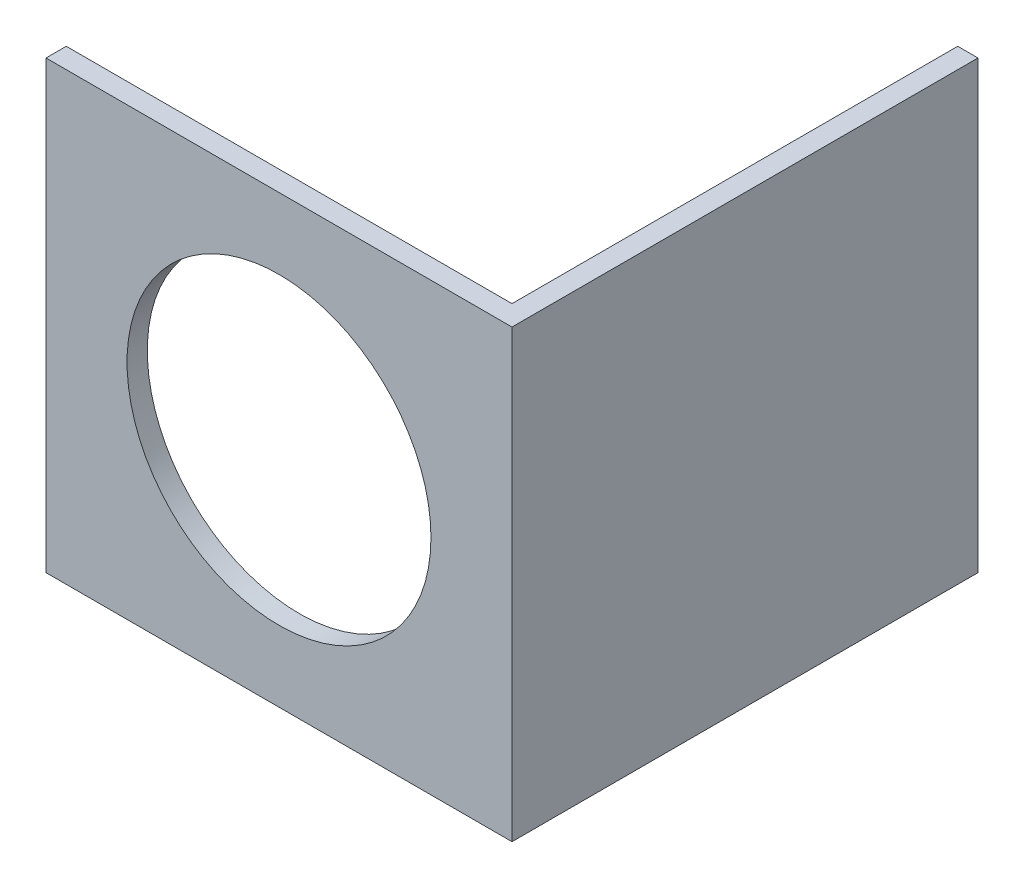
ISO-10303-21;
HEADER;
FILE_DESCRIPTION(('STEP AP214'),'2;1');
FILE_NAME('part.step','',(''),(''),'','','');
FILE_SCHEMA(('AUTOMOTIVE_DESIGN { 1 0 10303 214 1 1 1 1 }'));
ENDSEC;
DATA;
#1=APPLICATION_CONTEXT('core data for automotive mechanical design processes');
#2=APPLICATION_PROTOCOL_DEFINITION('international standard','automotive_design',2000,#1);
#3=PRODUCT_CONTEXT('',#1,'mechanical');
#4=PRODUCT('Part','Part','',(#3));
#5=PRODUCT_RELATED_PRODUCT_CATEGORY('part','',(#4));
#6=PRODUCT_DEFINITION_FORMATION('','',#4);
#7=PRODUCT_DEFINITION_CONTEXT('part definition',#1,'design');
#8=PRODUCT_DEFINITION('design','',#6,#7);
#9=PRODUCT_DEFINITION_SHAPE('','',#8);
#10=(LENGTH_UNIT() NAMED_UNIT(*) SI_UNIT(.MILLI.,.METRE.));
#11=(NAMED_UNIT(*) PLANE_ANGLE_UNIT() SI_UNIT($,.RADIAN.));
#12=(NAMED_UNIT(*) SI_UNIT($,.STERADIAN.) SOLID_ANGLE_UNIT());
#13=UNCERTAINTY_MEASURE_WITH_UNIT(LENGTH_MEASURE(1.E-05),#10,'distance_accuracy_value','');
#14=(GEOMETRIC_REPRESENTATION_CONTEXT(3) GLOBAL_UNCERTAINTY_ASSIGNED_CONTEXT((#13)) GLOBAL_UNIT_ASSIGNED_CONTEXT((#10,
#11,#12)) REPRESENTATION_CONTEXT('',''));
#15=CARTESIAN_POINT('',(0.,0.,0.));
#16=DIRECTION('',(0.,0.,1.));
#17=DIRECTION('',(1.,0.,0.));
#18=AXIS2_PLACEMENT_3D('',#15,#16,#17);
#19=CARTESIAN_POINT('',(-9.57987547909718,44.,17.5119931773014));
#20=DIRECTION('',(1.,0.,0.));
#21=DIRECTION('',(0.,0.,-1.));
#22=AXIS2_PLACEMENT_3D('',#19,#20,#21);
#23=PLANE('',#22);
#24=DIRECTION('',(0.,0.,1.));
#25=VECTOR('',#24,1.);
#26=CARTESIAN_POINT('',(-9.57987547909718,0.,17.5119931773014));
#27=LINE('',#26,#25);
#28=CARTESIAN_POINT('',(-9.57987547909718,0.,17.5119931773014));
#29=VERTEX_POINT('',#28);
#30=CARTESIAN_POINT('',(-9.57987547909718,0.,19.5119931773014));
#31=VERTEX_POINT('',#30);
#32=EDGE_CURVE('E118',#29,#31,#27,.T.);
#33=ORIENTED_EDGE('',*,*,#32,.T.);
#34=DIRECTION('',(0.,-1.,0.));
#35=VECTOR('',#34,1.);
#36=CARTESIAN_POINT('',(-9.57987547909718,44.,19.5119931773014));
#37=LINE('',#36,#35);
#38=CARTESIAN_POINT('',(-9.57987547909718,44.,19.5119931773014));
#39=VERTEX_POINT('',#38);
#40=EDGE_CURVE('E11',#39,#31,#37,.T.);
#41=ORIENTED_EDGE('',*,*,#40,.F.);
#42=DIRECTION('',(0.,0.,1.));
#43=VECTOR('',#42,1.);
#44=CARTESIAN_POINT('',(-9.57987547909718,44.,17.5119931773014));
#45=LINE('',#44,#43);
#46=CARTESIAN_POINT('',(-9.57987547909718,44.,17.5119931773014));
#47=VERTEX_POINT('',#46);
#48=EDGE_CURVE('E128',#47,#39,#45,.T.);
#49=ORIENTED_EDGE('',*,*,#48,.F.);
#50=DIRECTION('',(0.,-1.,0.));
#51=VECTOR('',#50,1.);
#52=CARTESIAN_POINT('',(-9.57987547909718,44.,17.5119931773014));
#53=LINE('',#52,#51);
#54=EDGE_CURVE('E114',#47,#29,#53,.T.);
#55=ORIENTED_EDGE('',*,*,#54,.T.);
#56=EDGE_LOOP('',(#33,#41,#49,#55));
#57=FACE_BOUND('',#56,.T.);
#58=ADVANCED_FACE('F33',(#57),#23,.F.);
#59=CARTESIAN_POINT('',(-9.57987547909718,44.,19.5119931773014));
#60=DIRECTION('',(0.,0.,-1.));
#61=DIRECTION('',(-1.,0.,0.));
#62=AXIS2_PLACEMENT_3D('',#59,#60,#61);
#63=PLANE('',#62);
#64=CARTESIAN_POINT('',(13.4201245209028,22.,19.5119931773014));
#65=DIRECTION('',(0.,0.,1.));
#66=DIRECTION('',(1.,0.,0.));
#67=AXIS2_PLACEMENT_3D('',#64,#65,#66);
#68=CIRCLE('',#67,15.);
#69=CARTESIAN_POINT('',(28.4201245209028,22.,19.5119931773014));
#70=VERTEX_POINT('',#69);
#71=EDGE_CURVE('E214',#70,#70,#68,.T.);
#72=ORIENTED_EDGE('',*,*,#71,.F.);
#73=EDGE_LOOP('',(#72));
#74=FACE_BOUND('',#73,.T.);
#75=DIRECTION('',(1.,0.,0.));
#76=VECTOR('',#75,1.);
#77=CARTESIAN_POINT('',(-9.57987547909718,0.,19.5119931773014));
#78=LINE('',#77,#76);
#79=CARTESIAN_POINT('',(36.4201245209028,0.,19.5119931773014));
#80=VERTEX_POINT('',#79);
#81=EDGE_CURVE('E121',#31,#80,#78,.T.);
#82=ORIENTED_EDGE('',*,*,#81,.T.);
#83=DIRECTION('',(0.,-1.,0.));
#84=VECTOR('',#83,1.);
#85=CARTESIAN_POINT('',(36.4201245209028,44.,19.5119931773014));
#86=LINE('',#85,#84);
#87=CARTESIAN_POINT('',(36.4201245209028,44.,19.5119931773014));
#88=VERTEX_POINT('',#87);
#89=EDGE_CURVE('E42',#88,#80,#86,.T.);
#90=ORIENTED_EDGE('',*,*,#89,.F.);
#91=DIRECTION('',(1.,0.,0.));
#92=VECTOR('',#91,1.);
#93=CARTESIAN_POINT('',(-9.57987547909718,44.,19.5119931773014));
#94=LINE('',#93,#92);
#95=EDGE_CURVE('E87',#39,#88,#94,.T.);
#96=ORIENTED_EDGE('',*,*,#95,.F.);
#97=ORIENTED_EDGE('',*,*,#40,.T.);
#98=EDGE_LOOP('',(#82,#90,#96,#97));
#99=FACE_BOUND('',#98,.T.);
#100=ADVANCED_FACE('F155',(#74,#99),#63,.F.);
#101=CARTESIAN_POINT('',(36.4201245209028,44.,19.5119931773014));
#102=DIRECTION('',(-1.,0.,0.));
#103=DIRECTION('',(0.,0.,1.));
#104=AXIS2_PLACEMENT_3D('',#101,#102,#103);
#105=PLANE('',#104);
#106=DIRECTION('',(0.,0.,-1.));
#107=VECTOR('',#106,1.);
#108=CARTESIAN_POINT('',(36.4201245209028,0.,19.5119931773014));
#109=LINE('',#108,#107);
#110=CARTESIAN_POINT('',(36.4201245209028,0.,-26.4880068226986));
#111=VERTEX_POINT('',#110);
#112=EDGE_CURVE('E123',#80,#111,#109,.T.);
#113=ORIENTED_EDGE('',*,*,#112,.T.);
#114=DIRECTION('',(0.,-1.,0.));
#115=VECTOR('',#114,1.);
#116=CARTESIAN_POINT('',(36.4201245209028,44.,-26.4880068226986));
#117=LINE('',#116,#115);
#118=CARTESIAN_POINT('',(36.4201245209028,44.,-26.4880068226986));
#119=VERTEX_POINT('',#118);
#120=EDGE_CURVE('E109',#119,#111,#117,.T.);
#121=ORIENTED_EDGE('',*,*,#120,.F.);
#122=DIRECTION('',(0.,0.,-1.));
#123=VECTOR('',#122,1.);
#124=CARTESIAN_POINT('',(36.4201245209028,44.,19.5119931773014));
#125=LINE('',#124,#123);
#126=EDGE_CURVE('E100',#88,#119,#125,.T.);
#127=ORIENTED_EDGE('',*,*,#126,.F.);
#128=ORIENTED_EDGE('',*,*,#89,.T.);
#129=EDGE_LOOP('',(#113,#121,#127,#128));
#130=FACE_BOUND('',#129,.T.);
#131=ADVANCED_FACE('F135',(#130),#105,.F.);
#132=CARTESIAN_POINT('',(36.4201245209028,44.,-26.4880068226986));
#133=DIRECTION('',(0.,0.,1.));
#134=DIRECTION('',(1.,0.,0.));
#135=AXIS2_PLACEMENT_3D('',#132,#133,#134);
#136=PLANE('',#135);
#137=DIRECTION('',(-1.,0.,0.));
#138=VECTOR('',#137,1.);
#139=CARTESIAN_POINT('',(36.4201245209028,0.,-26.4880068226986));
#140=LINE('',#139,#138);
#141=CARTESIAN_POINT('',(34.4201245209028,0.,-26.4880068226986));
#142=VERTEX_POINT('',#141);
#143=EDGE_CURVE('E108',#111,#142,#140,.T.);
#144=ORIENTED_EDGE('',*,*,#143,.T.);
#145=DIRECTION('',(0.,-1.,0.));
#146=VECTOR('',#145,1.);
#147=CARTESIAN_POINT('',(34.4201245209028,44.,-26.4880068226986));
#148=LINE('',#147,#146);
#149=CARTESIAN_POINT('',(34.4201245209028,44.,-26.4880068226986));
#150=VERTEX_POINT('',#149);
#151=EDGE_CURVE('E105',#150,#142,#148,.T.);
#152=ORIENTED_EDGE('',*,*,#151,.F.);
#153=DIRECTION('',(-1.,0.,0.));
#154=VECTOR('',#153,1.);
#155=CARTESIAN_POINT('',(36.4201245209028,44.,-26.4880068226986));
#156=LINE('',#155,#154);
#157=EDGE_CURVE('E94',#119,#150,#156,.T.);
#158=ORIENTED_EDGE('',*,*,#157,.F.);
#159=ORIENTED_EDGE('',*,*,#120,.T.);
#160=EDGE_LOOP('',(#144,#152,#158,#159));
#161=FACE_BOUND('',#160,.T.);
#162=ADVANCED_FACE('F106',(#161),#136,.F.);
#163=CARTESIAN_POINT('',(34.4201245209028,44.,-26.4880068226986));
#164=DIRECTION('',(1.,0.,0.));
#165=DIRECTION('',(0.,0.,-1.));
#166=AXIS2_PLACEMENT_3D('',#163,#164,#165);
#167=PLANE('',#166);
#168=DIRECTION('',(0.,0.,1.));
#169=VECTOR('',#168,1.);
#170=CARTESIAN_POINT('',(34.4201245209028,0.,-26.4880068226986));
#171=LINE('',#170,#169);
#172=CARTESIAN_POINT('',(34.4201245209028,0.,17.5119931773014));
#173=VERTEX_POINT('',#172);
#174=EDGE_CURVE('E73',#142,#173,#171,.T.);
#175=ORIENTED_EDGE('',*,*,#174,.T.);
#176=DIRECTION('',(0.,-1.,0.));
#177=VECTOR('',#176,1.);
#178=CARTESIAN_POINT('',(34.4201245209028,44.,17.5119931773014));
#179=LINE('',#178,#177);
#180=CARTESIAN_POINT('',(34.4201245209028,44.,17.5119931773014));
#181=VERTEX_POINT('',#180);
#182=EDGE_CURVE('E110',#181,#173,#179,.T.);
#183=ORIENTED_EDGE('',*,*,#182,.F.);
#184=DIRECTION('',(0.,0.,1.));
#185=VECTOR('',#184,1.);
#186=CARTESIAN_POINT('',(34.4201245209028,44.,-26.4880068226986));
#187=LINE('',#186,#185);
#188=EDGE_CURVE('E98',#150,#181,#187,.T.);
#189=ORIENTED_EDGE('',*,*,#188,.F.);
#190=ORIENTED_EDGE('',*,*,#151,.T.);
#191=EDGE_LOOP('',(#175,#183,#189,#190));
#192=FACE_BOUND('',#191,.T.);
#193=ADVANCED_FACE('F112',(#192),#167,.F.);
#194=CARTESIAN_POINT('',(34.4201245209028,44.,17.5119931773014));
#195=DIRECTION('',(0.,0.,1.));
#196=DIRECTION('',(1.,0.,0.));
#197=AXIS2_PLACEMENT_3D('',#194,#195,#196);
#198=PLANE('',#197);
#199=CARTESIAN_POINT('',(13.4201245209028,22.,17.5119931773014));
#200=DIRECTION('',(0.,0.,1.));
#201=DIRECTION('',(1.,0.,0.));
#202=AXIS2_PLACEMENT_3D('',#199,#200,#201);
#203=CIRCLE('',#202,15.);
#204=CARTESIAN_POINT('',(28.4201245209028,22.,17.5119931773014));
#205=VERTEX_POINT('',#204);
#206=EDGE_CURVE('E36',#205,#205,#203,.T.);
#207=ORIENTED_EDGE('',*,*,#206,.T.);
#208=EDGE_LOOP('',(#207));
#209=FACE_BOUND('',#208,.T.);
#210=DIRECTION('',(-1.,0.,0.));
#211=VECTOR('',#210,1.);
#212=CARTESIAN_POINT('',(34.4201245209028,0.,17.5119931773014));
#213=LINE('',#212,#211);
#214=EDGE_CURVE('E79',#173,#29,#213,.T.);
#215=ORIENTED_EDGE('',*,*,#214,.T.);
#216=ORIENTED_EDGE('',*,*,#54,.F.);
#217=DIRECTION('',(-1.,0.,0.));
#218=VECTOR('',#217,1.);
#219=CARTESIAN_POINT('',(34.4201245209028,44.,17.5119931773014));
#220=LINE('',#219,#218);
#221=EDGE_CURVE('E50',#181,#47,#220,.T.);
#222=ORIENTED_EDGE('',*,*,#221,.F.);
#223=ORIENTED_EDGE('',*,*,#182,.T.);
#224=EDGE_LOOP('',(#215,#216,#222,#223));
#225=FACE_BOUND('',#224,.T.);
#226=ADVANCED_FACE('F142',(#209,#225),#198,.F.);
#227=CARTESIAN_POINT('',(0.,44.,0.));
#228=DIRECTION('',(0.,1.,0.));
#229=DIRECTION('',(0.,0.,1.));
#230=AXIS2_PLACEMENT_3D('',#227,#228,#229);
#231=PLANE('',#230);
#232=ORIENTED_EDGE('',*,*,#48,.T.);
#233=ORIENTED_EDGE('',*,*,#95,.T.);
#234=ORIENTED_EDGE('',*,*,#126,.T.);
#235=ORIENTED_EDGE('',*,*,#157,.T.);
#236=ORIENTED_EDGE('',*,*,#188,.T.);
#237=ORIENTED_EDGE('',*,*,#221,.T.);
#238=EDGE_LOOP('',(#232,#233,#234,#235,#236,#237));
#239=FACE_BOUND('',#238,.T.);
#240=ADVANCED_FACE('F96',(#239),#231,.T.);
#241=CARTESIAN_POINT('',(0.,0.,0.));
#242=DIRECTION('',(0.,1.,0.));
#243=DIRECTION('',(0.,0.,1.));
#244=AXIS2_PLACEMENT_3D('',#241,#242,#243);
#245=PLANE('',#244);
#246=ORIENTED_EDGE('',*,*,#32,.F.);
#247=ORIENTED_EDGE('',*,*,#214,.F.);
#248=ORIENTED_EDGE('',*,*,#174,.F.);
#249=ORIENTED_EDGE('',*,*,#143,.F.);
#250=ORIENTED_EDGE('',*,*,#112,.F.);
#251=ORIENTED_EDGE('',*,*,#81,.F.);
#252=EDGE_LOOP('',(#246,#247,#248,#249,#250,#251));
#253=FACE_BOUND('',#252,.T.);
#254=ADVANCED_FACE('F138',(#253),#245,.F.);
#255=CARTESIAN_POINT('',(13.4201245209028,22.,-24.4880068226986));
#256=DIRECTION('',(0.,0.,1.));
#257=DIRECTION('',(1.,0.,0.));
#258=AXIS2_PLACEMENT_3D('',#255,#256,#257);
#259=CYLINDRICAL_SURFACE('',#258,15.);
#260=ORIENTED_EDGE('',*,*,#71,.T.);
#261=EDGE_LOOP('',(#260));
#262=FACE_BOUND('',#261,.T.);
#263=ORIENTED_EDGE('',*,*,#206,.F.);
#264=EDGE_LOOP('',(#263));
#265=FACE_BOUND('',#264,.T.);
#266=ADVANCED_FACE('F190',(#262,#265),#259,.F.);
#267=CLOSED_SHELL('',(#58,#100,#131,#162,#193,#226,#240,#254,#266));
#268=MANIFOLD_SOLID_BREP('B2',#267);
#269=ADVANCED_BREP_SHAPE_REPRESENTATION('',(#18,#268),#14);
#270=SHAPE_DEFINITION_REPRESENTATION(#9,#269);
ENDSEC;
END-ISO-10303-21;
